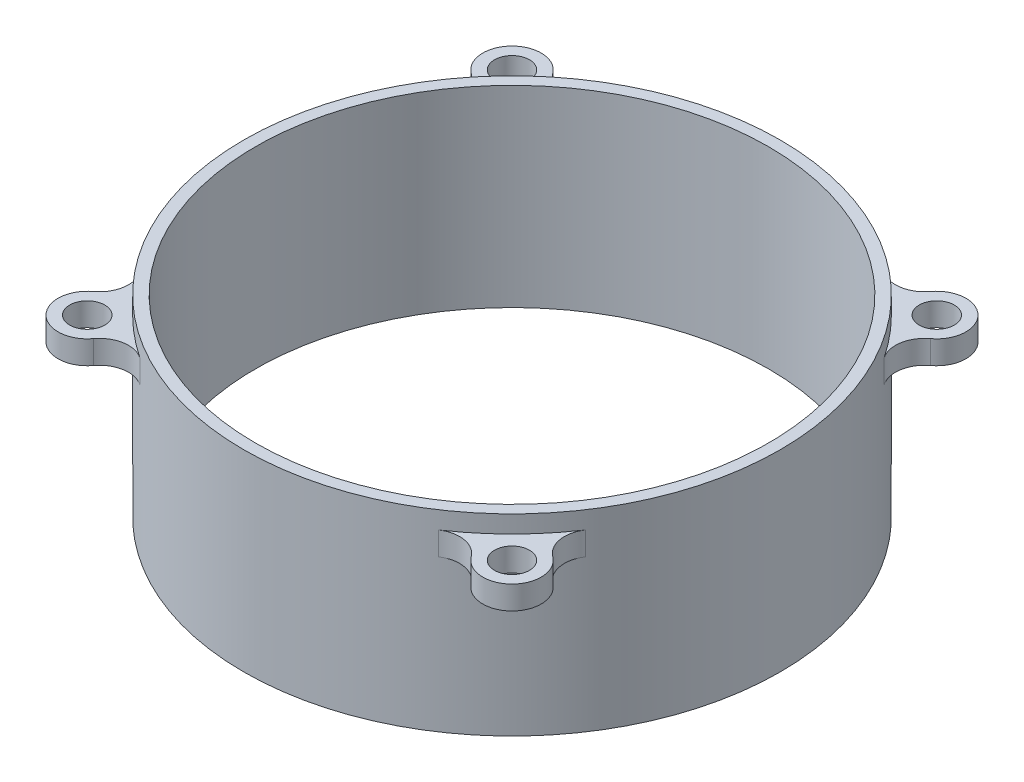
ISO-10303-21;
HEADER;
FILE_DESCRIPTION(('STEP AP214'),'2;1');
FILE_NAME('part.step','',(''),(''),'','','');
FILE_SCHEMA(('AUTOMOTIVE_DESIGN { 1 0 10303 214 1 1 1 1 }'));
ENDSEC;
DATA;
#1=APPLICATION_CONTEXT('core data for automotive mechanical design processes');
#2=APPLICATION_PROTOCOL_DEFINITION('international standard','automotive_design',2000,#1);
#3=PRODUCT_CONTEXT('',#1,'mechanical');
#4=PRODUCT('Part','Part','',(#3));
#5=PRODUCT_RELATED_PRODUCT_CATEGORY('part','',(#4));
#6=PRODUCT_DEFINITION_FORMATION('','',#4);
#7=PRODUCT_DEFINITION_CONTEXT('part definition',#1,'design');
#8=PRODUCT_DEFINITION('design','',#6,#7);
#9=PRODUCT_DEFINITION_SHAPE('','',#8);
#10=(LENGTH_UNIT() NAMED_UNIT(*) SI_UNIT(.MILLI.,.METRE.));
#11=(NAMED_UNIT(*) PLANE_ANGLE_UNIT() SI_UNIT($,.RADIAN.));
#12=(NAMED_UNIT(*) SI_UNIT($,.STERADIAN.) SOLID_ANGLE_UNIT());
#13=UNCERTAINTY_MEASURE_WITH_UNIT(LENGTH_MEASURE(1.E-05),#10,'distance_accuracy_value','');
#14=(GEOMETRIC_REPRESENTATION_CONTEXT(3) GLOBAL_UNCERTAINTY_ASSIGNED_CONTEXT((#13)) GLOBAL_UNIT_ASSIGNED_CONTEXT((#10,
#11,#12)) REPRESENTATION_CONTEXT('',''));
#15=CARTESIAN_POINT('',(0.,0.,0.));
#16=DIRECTION('',(0.,0.,1.));
#17=DIRECTION('',(1.,0.,0.));
#18=AXIS2_PLACEMENT_3D('',#15,#16,#17);
#19=CARTESIAN_POINT('',(23.,-2.,0.));
#20=DIRECTION('',(0.,-1.,0.));
#21=DIRECTION('',(0.,0.,-1.));
#22=AXIS2_PLACEMENT_3D('',#19,#20,#21);
#23=PLANE('',#22);
#24=CARTESIAN_POINT('',(18.2079996155536,-2.,-18.2079996155536));
#25=DIRECTION('',(0.,-1.,0.));
#26=DIRECTION('',(0.,0.,-1.));
#27=AXIS2_PLACEMENT_3D('',#24,#25,#26);
#28=CIRCLE('',#27,1.5);
#29=CARTESIAN_POINT('',(18.2079996155536,-2.,-19.7079996155536));
#30=VERTEX_POINT('',#29);
#31=EDGE_CURVE('E273',#30,#30,#28,.T.);
#32=ORIENTED_EDGE('',*,*,#31,.F.);
#33=EDGE_LOOP('',(#32));
#34=FACE_BOUND('',#33,.T.);
#35=CARTESIAN_POINT('',(0.,-2.,0.));
#36=DIRECTION('',(0.,-1.,0.));
#37=DIRECTION('',(0.,0.,-1.));
#38=AXIS2_PLACEMENT_3D('',#35,#36,#37);
#39=CIRCLE('',#38,23.);
#40=CARTESIAN_POINT('',(12.8002830451665,-2.,-19.1089705103028));
#41=VERTEX_POINT('',#40);
#42=CARTESIAN_POINT('',(19.1089705103028,-2.,-12.8002830451666));
#43=VERTEX_POINT('',#42);
#44=EDGE_CURVE('E291',#41,#43,#39,.T.);
#45=ORIENTED_EDGE('',*,*,#44,.F.);
#46=CARTESIAN_POINT('',(14.1916181587716,-2.,-21.1860325222922));
#47=DIRECTION('',(0.,-1.,0.));
#48=DIRECTION('',(0.,0.,-1.));
#49=AXIS2_PLACEMENT_3D('',#46,#47,#48);
#50=CIRCLE('',#49,2.50000000000001);
#51=CARTESIAN_POINT('',(16.1998088871626,-2.,-19.6970160689229));
#52=VERTEX_POINT('',#51);
#53=EDGE_CURVE('E253',#41,#52,#50,.F.);
#54=ORIENTED_EDGE('',*,*,#53,.T.);
#55=CARTESIAN_POINT('',(18.2079996155536,-2.,-18.2079996155536));
#56=DIRECTION('',(0.,-1.,0.));
#57=DIRECTION('',(0.,0.,-1.));
#58=AXIS2_PLACEMENT_3D('',#55,#56,#57);
#59=CIRCLE('',#58,2.50000000000002);
#60=CARTESIAN_POINT('',(19.6970160689229,-2.,-16.1998088871626));
#61=VERTEX_POINT('',#60);
#62=EDGE_CURVE('E251',#52,#61,#59,.T.);
#63=ORIENTED_EDGE('',*,*,#62,.T.);
#64=CARTESIAN_POINT('',(21.1860325222922,-2.,-14.1916181587716));
#65=DIRECTION('',(0.,-1.,0.));
#66=DIRECTION('',(0.,0.,-1.));
#67=AXIS2_PLACEMENT_3D('',#64,#65,#66);
#68=CIRCLE('',#67,2.5);
#69=EDGE_CURVE('E248',#61,#43,#68,.F.);
#70=ORIENTED_EDGE('',*,*,#69,.T.);
#71=EDGE_LOOP('',(#45,#54,#63,#70));
#72=FACE_BOUND('',#71,.T.);
#73=ADVANCED_FACE('F35',(#34,#72),#23,.T.);
#74=CARTESIAN_POINT('',(18.2079996155536,-2.,18.2079996155536));
#75=DIRECTION('',(0.,-1.,0.));
#76=DIRECTION('',(0.,0.,-1.));
#77=AXIS2_PLACEMENT_3D('',#74,#75,#76);
#78=CIRCLE('',#77,1.5);
#79=CARTESIAN_POINT('',(18.2079996155536,-2.,16.7079996155536));
#80=VERTEX_POINT('',#79);
#81=EDGE_CURVE('E276',#80,#80,#78,.T.);
#82=ORIENTED_EDGE('',*,*,#81,.F.);
#83=EDGE_LOOP('',(#82));
#84=FACE_BOUND('',#83,.T.);
#85=CARTESIAN_POINT('',(19.1089705103028,-2.,12.8002830451665));
#86=VERTEX_POINT('',#85);
#87=CARTESIAN_POINT('',(12.8002830451666,-2.,19.1089705103028));
#88=VERTEX_POINT('',#87);
#89=EDGE_CURVE('E295',#86,#88,#39,.T.);
#90=ORIENTED_EDGE('',*,*,#89,.F.);
#91=CARTESIAN_POINT('',(21.1860325222922,-2.,14.1916181587716));
#92=DIRECTION('',(0.,-1.,0.));
#93=DIRECTION('',(0.,0.,-1.));
#94=AXIS2_PLACEMENT_3D('',#91,#92,#93);
#95=CIRCLE('',#94,2.50000000000001);
#96=CARTESIAN_POINT('',(19.6970160689229,-2.,16.1998088871626));
#97=VERTEX_POINT('',#96);
#98=EDGE_CURVE('E245',#86,#97,#95,.F.);
#99=ORIENTED_EDGE('',*,*,#98,.T.);
#100=CARTESIAN_POINT('',(18.2079996155536,-2.,18.2079996155536));
#101=DIRECTION('',(0.,-1.,0.));
#102=DIRECTION('',(0.,0.,-1.));
#103=AXIS2_PLACEMENT_3D('',#100,#101,#102);
#104=CIRCLE('',#103,2.50000000000002);
#105=CARTESIAN_POINT('',(16.1998088871626,-2.,19.6970160689229));
#106=VERTEX_POINT('',#105);
#107=EDGE_CURVE('E243',#97,#106,#104,.T.);
#108=ORIENTED_EDGE('',*,*,#107,.T.);
#109=CARTESIAN_POINT('',(14.1916181587716,-2.,21.1860325222922));
#110=DIRECTION('',(0.,-1.,0.));
#111=DIRECTION('',(0.,0.,-1.));
#112=AXIS2_PLACEMENT_3D('',#109,#110,#111);
#113=CIRCLE('',#112,2.5);
#114=EDGE_CURVE('E240',#106,#88,#113,.F.);
#115=ORIENTED_EDGE('',*,*,#114,.T.);
#116=EDGE_LOOP('',(#90,#99,#108,#115));
#117=FACE_BOUND('',#116,.T.);
#118=ADVANCED_FACE('F317',(#84,#117),#23,.T.);
#119=CARTESIAN_POINT('',(-18.2079996155536,-2.,18.2079996155536));
#120=DIRECTION('',(0.,-1.,0.));
#121=DIRECTION('',(0.,0.,-1.));
#122=AXIS2_PLACEMENT_3D('',#119,#120,#121);
#123=CIRCLE('',#122,1.5);
#124=CARTESIAN_POINT('',(-18.2079996155536,-2.,16.7079996155536));
#125=VERTEX_POINT('',#124);
#126=EDGE_CURVE('E279',#125,#125,#123,.T.);
#127=ORIENTED_EDGE('',*,*,#126,.F.);
#128=EDGE_LOOP('',(#127));
#129=FACE_BOUND('',#128,.T.);
#130=CARTESIAN_POINT('',(-12.8002830451665,-2.,19.1089705103028));
#131=VERTEX_POINT('',#130);
#132=CARTESIAN_POINT('',(-19.1089705103028,-2.,12.8002830451666));
#133=VERTEX_POINT('',#132);
#134=EDGE_CURVE('E435',#131,#133,#39,.T.);
#135=ORIENTED_EDGE('',*,*,#134,.F.);
#136=CARTESIAN_POINT('',(-14.1916181587716,-2.,21.1860325222922));
#137=DIRECTION('',(0.,-1.,0.));
#138=DIRECTION('',(0.,0.,-1.));
#139=AXIS2_PLACEMENT_3D('',#136,#137,#138);
#140=CIRCLE('',#139,2.50000000000001);
#141=CARTESIAN_POINT('',(-16.1998088871626,-2.,19.6970160689229));
#142=VERTEX_POINT('',#141);
#143=EDGE_CURVE('E237',#131,#142,#140,.F.);
#144=ORIENTED_EDGE('',*,*,#143,.T.);
#145=CARTESIAN_POINT('',(-18.2079996155536,-2.,18.2079996155536));
#146=DIRECTION('',(0.,-1.,0.));
#147=DIRECTION('',(0.,0.,-1.));
#148=AXIS2_PLACEMENT_3D('',#145,#146,#147);
#149=CIRCLE('',#148,2.50000000000002);
#150=CARTESIAN_POINT('',(-19.6970160689229,-2.,16.1998088871626));
#151=VERTEX_POINT('',#150);
#152=EDGE_CURVE('E235',#142,#151,#149,.T.);
#153=ORIENTED_EDGE('',*,*,#152,.T.);
#154=CARTESIAN_POINT('',(-21.1860325222922,-2.,14.1916181587716));
#155=DIRECTION('',(0.,-1.,0.));
#156=DIRECTION('',(0.,0.,-1.));
#157=AXIS2_PLACEMENT_3D('',#154,#155,#156);
#158=CIRCLE('',#157,2.5);
#159=EDGE_CURVE('E232',#151,#133,#158,.F.);
#160=ORIENTED_EDGE('',*,*,#159,.T.);
#161=EDGE_LOOP('',(#135,#144,#153,#160));
#162=FACE_BOUND('',#161,.T.);
#163=ADVANCED_FACE('F323',(#129,#162),#23,.T.);
#164=CARTESIAN_POINT('',(-18.2079996155536,-2.,-18.2079996155536));
#165=DIRECTION('',(0.,-1.,0.));
#166=DIRECTION('',(0.,0.,-1.));
#167=AXIS2_PLACEMENT_3D('',#164,#165,#166);
#168=CIRCLE('',#167,1.5);
#169=CARTESIAN_POINT('',(-18.2079996155536,-2.,-19.7079996155536));
#170=VERTEX_POINT('',#169);
#171=EDGE_CURVE('E270',#170,#170,#168,.T.);
#172=ORIENTED_EDGE('',*,*,#171,.F.);
#173=EDGE_LOOP('',(#172));
#174=FACE_BOUND('',#173,.T.);
#175=CARTESIAN_POINT('',(-18.2079996155536,-2.,-18.2079996155536));
#176=DIRECTION('',(0.,-1.,0.));
#177=DIRECTION('',(0.,0.,-1.));
#178=AXIS2_PLACEMENT_3D('',#175,#176,#177);
#179=CIRCLE('',#178,2.50000000000002);
#180=CARTESIAN_POINT('',(-19.6970160689229,-2.,-16.1998088871626));
#181=VERTEX_POINT('',#180);
#182=CARTESIAN_POINT('',(-16.1998088871626,-2.,-19.6970160689229));
#183=VERTEX_POINT('',#182);
#184=EDGE_CURVE('E50',#181,#183,#179,.T.);
#185=ORIENTED_EDGE('',*,*,#184,.T.);
#186=CARTESIAN_POINT('',(-14.1916181587716,-2.,-21.1860325222922));
#187=DIRECTION('',(0.,-1.,0.));
#188=DIRECTION('',(0.,0.,-1.));
#189=AXIS2_PLACEMENT_3D('',#186,#187,#188);
#190=CIRCLE('',#189,2.5);
#191=CARTESIAN_POINT('',(-12.8002830451666,-2.,-19.1089705103028));
#192=VERTEX_POINT('',#191);
#193=EDGE_CURVE('E256',#183,#192,#190,.F.);
#194=ORIENTED_EDGE('',*,*,#193,.T.);
#195=CARTESIAN_POINT('',(-19.1089705103028,-2.,-12.8002830451665));
#196=VERTEX_POINT('',#195);
#197=EDGE_CURVE('E289',#196,#192,#39,.T.);
#198=ORIENTED_EDGE('',*,*,#197,.F.);
#199=CARTESIAN_POINT('',(-21.1860325222922,-2.,-14.1916181587716));
#200=DIRECTION('',(0.,-1.,0.));
#201=DIRECTION('',(0.,0.,-1.));
#202=AXIS2_PLACEMENT_3D('',#199,#200,#201);
#203=CIRCLE('',#202,2.50000000000001);
#204=EDGE_CURVE('E230',#196,#181,#203,.F.);
#205=ORIENTED_EDGE('',*,*,#204,.T.);
#206=EDGE_LOOP('',(#185,#194,#198,#205));
#207=FACE_BOUND('',#206,.T.);
#208=ADVANCED_FACE('F319',(#174,#207),#23,.T.);
#209=CARTESIAN_POINT('',(28.25,0.,0.));
#210=DIRECTION('',(0.,1.,0.));
#211=DIRECTION('',(0.,0.,1.));
#212=AXIS2_PLACEMENT_3D('',#209,#210,#211);
#213=PLANE('',#212);
#214=CARTESIAN_POINT('',(18.2079996155536,0.,-18.2079996155536));
#215=DIRECTION('',(0.,1.,0.));
#216=DIRECTION('',(0.,0.,1.));
#217=AXIS2_PLACEMENT_3D('',#214,#215,#216);
#218=CIRCLE('',#217,1.5);
#219=CARTESIAN_POINT('',(18.2079996155536,0.,-16.7079996155536));
#220=VERTEX_POINT('',#219);
#221=EDGE_CURVE('E259',#220,#220,#218,.T.);
#222=ORIENTED_EDGE('',*,*,#221,.F.);
#223=EDGE_LOOP('',(#222));
#224=FACE_BOUND('',#223,.T.);
#225=CARTESIAN_POINT('',(18.2079996155536,0.,-18.2079996155536));
#226=DIRECTION('',(0.,1.,0.));
#227=DIRECTION('',(0.,0.,1.));
#228=AXIS2_PLACEMENT_3D('',#225,#226,#227);
#229=CIRCLE('',#228,2.50000000000002);
#230=CARTESIAN_POINT('',(19.6970160689229,0.,-16.1998088871626));
#231=VERTEX_POINT('',#230);
#232=CARTESIAN_POINT('',(16.1998088871626,0.,-19.6970160689229));
#233=VERTEX_POINT('',#232);
#234=EDGE_CURVE('E193',#231,#233,#229,.T.);
#235=ORIENTED_EDGE('',*,*,#234,.T.);
#236=CARTESIAN_POINT('',(14.1916181587716,0.,-21.1860325222922));
#237=DIRECTION('',(0.,-1.,0.));
#238=DIRECTION('',(0.,0.,-1.));
#239=AXIS2_PLACEMENT_3D('',#236,#237,#238);
#240=CIRCLE('',#239,2.50000000000001);
#241=CARTESIAN_POINT('',(12.8002830451665,0.,-19.1089705103028));
#242=VERTEX_POINT('',#241);
#243=EDGE_CURVE('E196',#233,#242,#240,.T.);
#244=ORIENTED_EDGE('',*,*,#243,.T.);
#245=CARTESIAN_POINT('',(0.,0.,0.));
#246=DIRECTION('',(0.,-1.,0.));
#247=DIRECTION('',(0.,0.,-1.));
#248=AXIS2_PLACEMENT_3D('',#245,#246,#247);
#249=CIRCLE('',#248,23.);
#250=CARTESIAN_POINT('',(19.1089705103028,0.,-12.8002830451666));
#251=VERTEX_POINT('',#250);
#252=EDGE_CURVE('E286',#242,#251,#249,.T.);
#253=ORIENTED_EDGE('',*,*,#252,.T.);
#254=CARTESIAN_POINT('',(21.1860325222922,0.,-14.1916181587716));
#255=DIRECTION('',(0.,-1.,0.));
#256=DIRECTION('',(0.,0.,1.));
#257=AXIS2_PLACEMENT_3D('',#254,#255,#256);
#258=CIRCLE('',#257,2.5);
#259=EDGE_CURVE('E190',#251,#231,#258,.T.);
#260=ORIENTED_EDGE('',*,*,#259,.T.);
#261=EDGE_LOOP('',(#235,#244,#253,#260));
#262=FACE_BOUND('',#261,.T.);
#263=ADVANCED_FACE('F329',(#224,#262),#213,.T.);
#264=CARTESIAN_POINT('',(18.2079996155536,0.,18.2079996155536));
#265=DIRECTION('',(0.,1.,0.));
#266=DIRECTION('',(0.,0.,1.));
#267=AXIS2_PLACEMENT_3D('',#264,#265,#266);
#268=CIRCLE('',#267,1.5);
#269=CARTESIAN_POINT('',(18.2079996155536,0.,19.7079996155536));
#270=VERTEX_POINT('',#269);
#271=EDGE_CURVE('E263',#270,#270,#268,.T.);
#272=ORIENTED_EDGE('',*,*,#271,.F.);
#273=EDGE_LOOP('',(#272));
#274=FACE_BOUND('',#273,.T.);
#275=CARTESIAN_POINT('',(18.2079996155536,0.,18.2079996155536));
#276=DIRECTION('',(0.,1.,0.));
#277=DIRECTION('',(0.,0.,1.));
#278=AXIS2_PLACEMENT_3D('',#275,#276,#277);
#279=CIRCLE('',#278,2.50000000000002);
#280=CARTESIAN_POINT('',(16.1998088871626,0.,19.6970160689229));
#281=VERTEX_POINT('',#280);
#282=CARTESIAN_POINT('',(19.6970160689229,0.,16.1998088871626));
#283=VERTEX_POINT('',#282);
#284=EDGE_CURVE('E184',#281,#283,#279,.T.);
#285=ORIENTED_EDGE('',*,*,#284,.T.);
#286=CARTESIAN_POINT('',(21.1860325222922,0.,14.1916181587716));
#287=DIRECTION('',(0.,-1.,0.));
#288=DIRECTION('',(0.,0.,-1.));
#289=AXIS2_PLACEMENT_3D('',#286,#287,#288);
#290=CIRCLE('',#289,2.50000000000001);
#291=CARTESIAN_POINT('',(19.1089705103028,0.,12.8002830451665));
#292=VERTEX_POINT('',#291);
#293=EDGE_CURVE('E187',#283,#292,#290,.T.);
#294=ORIENTED_EDGE('',*,*,#293,.T.);
#295=CARTESIAN_POINT('',(12.8002830451666,0.,19.1089705103028));
#296=VERTEX_POINT('',#295);
#297=EDGE_CURVE('E290',#292,#296,#249,.T.);
#298=ORIENTED_EDGE('',*,*,#297,.T.);
#299=CARTESIAN_POINT('',(14.1916181587716,0.,21.1860325222922));
#300=DIRECTION('',(0.,-1.,0.));
#301=DIRECTION('',(0.,0.,1.));
#302=AXIS2_PLACEMENT_3D('',#299,#300,#301);
#303=CIRCLE('',#302,2.5);
#304=EDGE_CURVE('E58',#296,#281,#303,.T.);
#305=ORIENTED_EDGE('',*,*,#304,.T.);
#306=EDGE_LOOP('',(#285,#294,#298,#305));
#307=FACE_BOUND('',#306,.T.);
#308=ADVANCED_FACE('F335',(#274,#307),#213,.T.);
#309=CARTESIAN_POINT('',(-18.2079996155536,0.,18.2079996155536));
#310=DIRECTION('',(0.,1.,0.));
#311=DIRECTION('',(0.,0.,1.));
#312=AXIS2_PLACEMENT_3D('',#309,#310,#311);
#313=CIRCLE('',#312,1.5);
#314=CARTESIAN_POINT('',(-18.2079996155536,0.,19.7079996155536));
#315=VERTEX_POINT('',#314);
#316=EDGE_CURVE('E258',#315,#315,#313,.T.);
#317=ORIENTED_EDGE('',*,*,#316,.F.);
#318=EDGE_LOOP('',(#317));
#319=FACE_BOUND('',#318,.T.);
#320=CARTESIAN_POINT('',(-18.2079996155536,0.,18.2079996155536));
#321=DIRECTION('',(0.,1.,0.));
#322=DIRECTION('',(0.,0.,1.));
#323=AXIS2_PLACEMENT_3D('',#320,#321,#322);
#324=CIRCLE('',#323,2.50000000000002);
#325=CARTESIAN_POINT('',(-19.6970160689229,0.,16.1998088871626));
#326=VERTEX_POINT('',#325);
#327=CARTESIAN_POINT('',(-16.1998088871626,0.,19.6970160689229));
#328=VERTEX_POINT('',#327);
#329=EDGE_CURVE('E177',#326,#328,#324,.T.);
#330=ORIENTED_EDGE('',*,*,#329,.T.);
#331=CARTESIAN_POINT('',(-14.1916181587716,0.,21.1860325222922));
#332=DIRECTION('',(0.,-1.,0.));
#333=DIRECTION('',(0.,0.,-1.));
#334=AXIS2_PLACEMENT_3D('',#331,#332,#333);
#335=CIRCLE('',#334,2.50000000000001);
#336=CARTESIAN_POINT('',(-12.8002830451665,0.,19.1089705103028));
#337=VERTEX_POINT('',#336);
#338=EDGE_CURVE('E180',#328,#337,#335,.T.);
#339=ORIENTED_EDGE('',*,*,#338,.T.);
#340=CARTESIAN_POINT('',(-19.1089705103028,0.,12.8002830451666));
#341=VERTEX_POINT('',#340);
#342=EDGE_CURVE('E437',#337,#341,#249,.T.);
#343=ORIENTED_EDGE('',*,*,#342,.T.);
#344=CARTESIAN_POINT('',(-21.1860325222922,0.,14.1916181587716));
#345=DIRECTION('',(0.,-1.,0.));
#346=DIRECTION('',(0.,0.,1.));
#347=AXIS2_PLACEMENT_3D('',#344,#345,#346);
#348=CIRCLE('',#347,2.5);
#349=EDGE_CURVE('E166',#341,#326,#348,.T.);
#350=ORIENTED_EDGE('',*,*,#349,.T.);
#351=EDGE_LOOP('',(#330,#339,#343,#350));
#352=FACE_BOUND('',#351,.T.);
#353=ADVANCED_FACE('F347',(#319,#352),#213,.T.);
#354=CARTESIAN_POINT('',(-18.2079996155536,0.,-18.2079996155536));
#355=DIRECTION('',(0.,1.,0.));
#356=DIRECTION('',(0.,0.,1.));
#357=AXIS2_PLACEMENT_3D('',#354,#355,#356);
#358=CIRCLE('',#357,1.5);
#359=CARTESIAN_POINT('',(-18.2079996155536,0.,-16.7079996155536));
#360=VERTEX_POINT('',#359);
#361=EDGE_CURVE('E262',#360,#360,#358,.T.);
#362=ORIENTED_EDGE('',*,*,#361,.F.);
#363=EDGE_LOOP('',(#362));
#364=FACE_BOUND('',#363,.T.);
#365=CARTESIAN_POINT('',(-19.1089705103028,0.,-12.8002830451665));
#366=VERTEX_POINT('',#365);
#367=CARTESIAN_POINT('',(-12.8002830451666,0.,-19.1089705103028));
#368=VERTEX_POINT('',#367);
#369=EDGE_CURVE('E285',#366,#368,#249,.T.);
#370=ORIENTED_EDGE('',*,*,#369,.T.);
#371=CARTESIAN_POINT('',(-14.1916181587716,0.,-21.1860325222922));
#372=DIRECTION('',(0.,-1.,0.));
#373=DIRECTION('',(0.,0.,1.));
#374=AXIS2_PLACEMENT_3D('',#371,#372,#373);
#375=CIRCLE('',#374,2.5);
#376=CARTESIAN_POINT('',(-16.1998088871626,0.,-19.6970160689229));
#377=VERTEX_POINT('',#376);
#378=EDGE_CURVE('E171',#368,#377,#375,.T.);
#379=ORIENTED_EDGE('',*,*,#378,.T.);
#380=CARTESIAN_POINT('',(-18.2079996155536,0.,-18.2079996155536));
#381=DIRECTION('',(0.,1.,0.));
#382=DIRECTION('',(0.,0.,1.));
#383=AXIS2_PLACEMENT_3D('',#380,#381,#382);
#384=CIRCLE('',#383,2.50000000000002);
#385=CARTESIAN_POINT('',(-19.6970160689229,0.,-16.1998088871626));
#386=VERTEX_POINT('',#385);
#387=EDGE_CURVE('E153',#377,#386,#384,.T.);
#388=ORIENTED_EDGE('',*,*,#387,.T.);
#389=CARTESIAN_POINT('',(-21.1860325222922,0.,-14.1916181587716));
#390=DIRECTION('',(0.,-1.,0.));
#391=DIRECTION('',(0.,0.,-1.));
#392=AXIS2_PLACEMENT_3D('',#389,#390,#391);
#393=CIRCLE('',#392,2.50000000000001);
#394=EDGE_CURVE('E160',#386,#366,#393,.T.);
#395=ORIENTED_EDGE('',*,*,#394,.T.);
#396=EDGE_LOOP('',(#370,#379,#388,#395));
#397=FACE_BOUND('',#396,.T.);
#398=ADVANCED_FACE('F169',(#364,#397),#213,.T.);
#399=CARTESIAN_POINT('',(23.,1.5,0.));
#400=DIRECTION('',(0.,1.,0.));
#401=DIRECTION('',(0.,0.,1.));
#402=AXIS2_PLACEMENT_3D('',#399,#400,#401);
#403=PLANE('',#402);
#404=CARTESIAN_POINT('',(0.,1.5,0.));
#405=DIRECTION('',(0.,-1.,0.));
#406=DIRECTION('',(0.,0.,-1.));
#407=AXIS2_PLACEMENT_3D('',#404,#405,#406);
#408=CIRCLE('',#407,22.);
#409=CARTESIAN_POINT('',(0.,1.5,-22.));
#410=VERTEX_POINT('',#409);
#411=EDGE_CURVE('E12',#410,#410,#408,.T.);
#412=ORIENTED_EDGE('',*,*,#411,.T.);
#413=EDGE_LOOP('',(#412));
#414=FACE_BOUND('',#413,.T.);
#415=CARTESIAN_POINT('',(0.,1.5,0.));
#416=DIRECTION('',(0.,-1.,0.));
#417=DIRECTION('',(0.,0.,-1.));
#418=AXIS2_PLACEMENT_3D('',#415,#416,#417);
#419=CIRCLE('',#418,23.);
#420=CARTESIAN_POINT('',(0.,1.5,-23.));
#421=VERTEX_POINT('',#420);
#422=EDGE_CURVE('E282',#421,#421,#419,.T.);
#423=ORIENTED_EDGE('',*,*,#422,.F.);
#424=EDGE_LOOP('',(#423));
#425=FACE_BOUND('',#424,.T.);
#426=ADVANCED_FACE('F37',(#414,#425),#403,.T.);
#427=CARTESIAN_POINT('',(0.,0.,0.));
#428=DIRECTION('',(0.,-1.,0.));
#429=DIRECTION('',(0.,0.,-1.));
#430=AXIS2_PLACEMENT_3D('',#427,#428,#429);
#431=CYLINDRICAL_SURFACE('',#430,22.);
#432=CARTESIAN_POINT('',(0.,-15.,0.));
#433=DIRECTION('',(0.,-1.,0.));
#434=DIRECTION('',(0.,0.,-1.));
#435=AXIS2_PLACEMENT_3D('',#432,#433,#434);
#436=CIRCLE('',#435,22.);
#437=CARTESIAN_POINT('',(0.,-15.,-22.));
#438=VERTEX_POINT('',#437);
#439=EDGE_CURVE('E43',#438,#438,#436,.T.);
#440=ORIENTED_EDGE('',*,*,#439,.T.);
#441=EDGE_LOOP('',(#440));
#442=FACE_BOUND('',#441,.T.);
#443=ORIENTED_EDGE('',*,*,#411,.F.);
#444=EDGE_LOOP('',(#443));
#445=FACE_BOUND('',#444,.T.);
#446=ADVANCED_FACE('F300',(#442,#445),#431,.F.);
#447=CARTESIAN_POINT('',(22.,-15.,0.));
#448=DIRECTION('',(0.,-1.,0.));
#449=DIRECTION('',(0.,0.,-1.));
#450=AXIS2_PLACEMENT_3D('',#447,#448,#449);
#451=PLANE('',#450);
#452=CARTESIAN_POINT('',(0.,-15.,0.));
#453=DIRECTION('',(0.,-1.,0.));
#454=DIRECTION('',(0.,0.,-1.));
#455=AXIS2_PLACEMENT_3D('',#452,#453,#454);
#456=CIRCLE('',#455,23.);
#457=CARTESIAN_POINT('',(0.,-15.,-23.));
#458=VERTEX_POINT('',#457);
#459=EDGE_CURVE('E294',#458,#458,#456,.T.);
#460=ORIENTED_EDGE('',*,*,#459,.T.);
#461=EDGE_LOOP('',(#460));
#462=FACE_BOUND('',#461,.T.);
#463=ORIENTED_EDGE('',*,*,#439,.F.);
#464=EDGE_LOOP('',(#463));
#465=FACE_BOUND('',#464,.T.);
#466=ADVANCED_FACE('F303',(#462,#465),#451,.T.);
#467=CARTESIAN_POINT('',(0.,0.,0.));
#468=DIRECTION('',(0.,-1.,0.));
#469=DIRECTION('',(0.,0.,-1.));
#470=AXIS2_PLACEMENT_3D('',#467,#468,#469);
#471=CYLINDRICAL_SURFACE('',#470,23.);
#472=ORIENTED_EDGE('',*,*,#197,.T.);
#473=DIRECTION('',(0.,1.,0.));
#474=VECTOR('',#473,1.);
#475=CARTESIAN_POINT('',(-12.8002830451666,-15.,-19.1089705103028));
#476=LINE('',#475,#474);
#477=EDGE_CURVE('E199',#192,#368,#476,.T.);
#478=ORIENTED_EDGE('',*,*,#477,.T.);
#479=ORIENTED_EDGE('',*,*,#369,.F.);
#480=DIRECTION('',(0.,1.,0.));
#481=VECTOR('',#480,1.);
#482=CARTESIAN_POINT('',(-19.1089705103028,-15.,-12.8002830451665));
#483=LINE('',#482,#481);
#484=EDGE_CURVE('E156',#196,#366,#483,.T.);
#485=ORIENTED_EDGE('',*,*,#484,.F.);
#486=EDGE_LOOP('',(#472,#478,#479,#485));
#487=FACE_BOUND('',#486,.T.);
#488=DIRECTION('',(0.,1.,0.));
#489=VECTOR('',#488,1.);
#490=CARTESIAN_POINT('',(12.8002830451665,-15.,-19.1089705103028));
#491=LINE('',#490,#489);
#492=EDGE_CURVE('E201',#41,#242,#491,.T.);
#493=ORIENTED_EDGE('',*,*,#492,.F.);
#494=ORIENTED_EDGE('',*,*,#44,.T.);
#495=DIRECTION('',(0.,1.,0.));
#496=VECTOR('',#495,1.);
#497=CARTESIAN_POINT('',(19.1089705103028,-15.,-12.8002830451666));
#498=LINE('',#497,#496);
#499=EDGE_CURVE('E208',#43,#251,#498,.T.);
#500=ORIENTED_EDGE('',*,*,#499,.T.);
#501=ORIENTED_EDGE('',*,*,#252,.F.);
#502=EDGE_LOOP('',(#493,#494,#500,#501));
#503=FACE_BOUND('',#502,.T.);
#504=DIRECTION('',(0.,1.,0.));
#505=VECTOR('',#504,1.);
#506=CARTESIAN_POINT('',(19.1089705103028,-15.,12.8002830451665));
#507=LINE('',#506,#505);
#508=EDGE_CURVE('E210',#86,#292,#507,.T.);
#509=ORIENTED_EDGE('',*,*,#508,.F.);
#510=ORIENTED_EDGE('',*,*,#89,.T.);
#511=DIRECTION('',(0.,1.,0.));
#512=VECTOR('',#511,1.);
#513=CARTESIAN_POINT('',(12.8002830451666,-15.,19.1089705103028));
#514=LINE('',#513,#512);
#515=EDGE_CURVE('E216',#88,#296,#514,.T.);
#516=ORIENTED_EDGE('',*,*,#515,.T.);
#517=ORIENTED_EDGE('',*,*,#297,.F.);
#518=EDGE_LOOP('',(#509,#510,#516,#517));
#519=FACE_BOUND('',#518,.T.);
#520=DIRECTION('',(0.,1.,0.));
#521=VECTOR('',#520,1.);
#522=CARTESIAN_POINT('',(-12.8002830451665,-15.,19.1089705103028));
#523=LINE('',#522,#521);
#524=EDGE_CURVE('E218',#131,#337,#523,.T.);
#525=ORIENTED_EDGE('',*,*,#524,.F.);
#526=ORIENTED_EDGE('',*,*,#134,.T.);
#527=DIRECTION('',(0.,1.,0.));
#528=VECTOR('',#527,1.);
#529=CARTESIAN_POINT('',(-19.1089705103028,-15.,12.8002830451666));
#530=LINE('',#529,#528);
#531=EDGE_CURVE('E225',#133,#341,#530,.T.);
#532=ORIENTED_EDGE('',*,*,#531,.T.);
#533=ORIENTED_EDGE('',*,*,#342,.F.);
#534=EDGE_LOOP('',(#525,#526,#532,#533));
#535=FACE_BOUND('',#534,.T.);
#536=ORIENTED_EDGE('',*,*,#422,.T.);
#537=EDGE_LOOP('',(#536));
#538=FACE_BOUND('',#537,.T.);
#539=ORIENTED_EDGE('',*,*,#459,.F.);
#540=EDGE_LOOP('',(#539));
#541=FACE_BOUND('',#540,.T.);
#542=ADVANCED_FACE('F305',(#487,#503,#519,#535,#538,#541),#471,.T.);
#543=CARTESIAN_POINT('',(-18.2079996155536,-15.,-18.2079996155536));
#544=DIRECTION('',(0.,1.,0.));
#545=DIRECTION('',(0.,0.,1.));
#546=AXIS2_PLACEMENT_3D('',#543,#544,#545);
#547=CYLINDRICAL_SURFACE('',#546,1.5);
#548=ORIENTED_EDGE('',*,*,#171,.T.);
#549=EDGE_LOOP('',(#548));
#550=FACE_BOUND('',#549,.T.);
#551=ORIENTED_EDGE('',*,*,#361,.T.);
#552=EDGE_LOOP('',(#551));
#553=FACE_BOUND('',#552,.T.);
#554=ADVANCED_FACE('F312',(#550,#553),#547,.F.);
#555=CARTESIAN_POINT('',(18.2079996155536,-15.,-18.2079996155536));
#556=DIRECTION('',(0.,1.,0.));
#557=DIRECTION('',(0.,0.,1.));
#558=AXIS2_PLACEMENT_3D('',#555,#556,#557);
#559=CYLINDRICAL_SURFACE('',#558,1.5);
#560=ORIENTED_EDGE('',*,*,#31,.T.);
#561=EDGE_LOOP('',(#560));
#562=FACE_BOUND('',#561,.T.);
#563=ORIENTED_EDGE('',*,*,#221,.T.);
#564=EDGE_LOOP('',(#563));
#565=FACE_BOUND('',#564,.T.);
#566=ADVANCED_FACE('F342',(#562,#565),#559,.F.);
#567=CARTESIAN_POINT('',(18.2079996155536,-15.,18.2079996155536));
#568=DIRECTION('',(0.,1.,0.));
#569=DIRECTION('',(0.,0.,1.));
#570=AXIS2_PLACEMENT_3D('',#567,#568,#569);
#571=CYLINDRICAL_SURFACE('',#570,1.5);
#572=ORIENTED_EDGE('',*,*,#81,.T.);
#573=EDGE_LOOP('',(#572));
#574=FACE_BOUND('',#573,.T.);
#575=ORIENTED_EDGE('',*,*,#271,.T.);
#576=EDGE_LOOP('',(#575));
#577=FACE_BOUND('',#576,.T.);
#578=ADVANCED_FACE('F359',(#574,#577),#571,.F.);
#579=CARTESIAN_POINT('',(-18.2079996155536,-15.,18.2079996155536));
#580=DIRECTION('',(0.,1.,0.));
#581=DIRECTION('',(0.,0.,1.));
#582=AXIS2_PLACEMENT_3D('',#579,#580,#581);
#583=CYLINDRICAL_SURFACE('',#582,1.5);
#584=ORIENTED_EDGE('',*,*,#126,.T.);
#585=EDGE_LOOP('',(#584));
#586=FACE_BOUND('',#585,.T.);
#587=ORIENTED_EDGE('',*,*,#316,.T.);
#588=EDGE_LOOP('',(#587));
#589=FACE_BOUND('',#588,.T.);
#590=ADVANCED_FACE('F355',(#586,#589),#583,.F.);
#591=CARTESIAN_POINT('',(18.2079996155536,-15.,-18.2079996155536));
#592=DIRECTION('',(0.,1.,0.));
#593=DIRECTION('',(0.,0.,1.));
#594=AXIS2_PLACEMENT_3D('',#591,#592,#593);
#595=CYLINDRICAL_SURFACE('',#594,2.50000000000002);
#596=DIRECTION('',(0.,1.,0.));
#597=VECTOR('',#596,1.);
#598=CARTESIAN_POINT('',(16.1998088871626,-15.,-19.6970160689229));
#599=LINE('',#598,#597);
#600=EDGE_CURVE('E203',#52,#233,#599,.T.);
#601=ORIENTED_EDGE('',*,*,#600,.T.);
#602=ORIENTED_EDGE('',*,*,#234,.F.);
#603=DIRECTION('',(0.,1.,0.));
#604=VECTOR('',#603,1.);
#605=CARTESIAN_POINT('',(19.6970160689229,-15.,-16.1998088871626));
#606=LINE('',#605,#604);
#607=EDGE_CURVE('E205',#61,#231,#606,.T.);
#608=ORIENTED_EDGE('',*,*,#607,.F.);
#609=ORIENTED_EDGE('',*,*,#62,.F.);
#610=EDGE_LOOP('',(#601,#602,#608,#609));
#611=FACE_BOUND('',#610,.T.);
#612=ADVANCED_FACE('F358',(#611),#595,.T.);
#613=CARTESIAN_POINT('',(18.2079996155536,-15.,18.2079996155536));
#614=DIRECTION('',(0.,1.,0.));
#615=DIRECTION('',(0.,0.,1.));
#616=AXIS2_PLACEMENT_3D('',#613,#614,#615);
#617=CYLINDRICAL_SURFACE('',#616,2.50000000000002);
#618=DIRECTION('',(0.,1.,0.));
#619=VECTOR('',#618,1.);
#620=CARTESIAN_POINT('',(19.6970160689229,-15.,16.1998088871626));
#621=LINE('',#620,#619);
#622=EDGE_CURVE('E212',#97,#283,#621,.T.);
#623=ORIENTED_EDGE('',*,*,#622,.T.);
#624=ORIENTED_EDGE('',*,*,#284,.F.);
#625=DIRECTION('',(0.,1.,0.));
#626=VECTOR('',#625,1.);
#627=CARTESIAN_POINT('',(16.1998088871626,-15.,19.6970160689229));
#628=LINE('',#627,#626);
#629=EDGE_CURVE('E214',#106,#281,#628,.T.);
#630=ORIENTED_EDGE('',*,*,#629,.F.);
#631=ORIENTED_EDGE('',*,*,#107,.F.);
#632=EDGE_LOOP('',(#623,#624,#630,#631));
#633=FACE_BOUND('',#632,.T.);
#634=ADVANCED_FACE('F384',(#633),#617,.T.);
#635=CARTESIAN_POINT('',(-18.2079996155536,-15.,18.2079996155536));
#636=DIRECTION('',(0.,1.,0.));
#637=DIRECTION('',(0.,0.,1.));
#638=AXIS2_PLACEMENT_3D('',#635,#636,#637);
#639=CYLINDRICAL_SURFACE('',#638,2.50000000000002);
#640=DIRECTION('',(0.,1.,0.));
#641=VECTOR('',#640,1.);
#642=CARTESIAN_POINT('',(-16.1998088871626,-15.,19.6970160689229));
#643=LINE('',#642,#641);
#644=EDGE_CURVE('E220',#142,#328,#643,.T.);
#645=ORIENTED_EDGE('',*,*,#644,.T.);
#646=ORIENTED_EDGE('',*,*,#329,.F.);
#647=DIRECTION('',(0.,1.,0.));
#648=VECTOR('',#647,1.);
#649=CARTESIAN_POINT('',(-19.6970160689229,-15.,16.1998088871626));
#650=LINE('',#649,#648);
#651=EDGE_CURVE('E222',#151,#326,#650,.T.);
#652=ORIENTED_EDGE('',*,*,#651,.F.);
#653=ORIENTED_EDGE('',*,*,#152,.F.);
#654=EDGE_LOOP('',(#645,#646,#652,#653));
#655=FACE_BOUND('',#654,.T.);
#656=ADVANCED_FACE('F374',(#655),#639,.T.);
#657=CARTESIAN_POINT('',(-18.2079996155536,-15.,-18.2079996155536));
#658=DIRECTION('',(0.,1.,0.));
#659=DIRECTION('',(0.,0.,1.));
#660=AXIS2_PLACEMENT_3D('',#657,#658,#659);
#661=CYLINDRICAL_SURFACE('',#660,2.50000000000002);
#662=DIRECTION('',(0.,1.,0.));
#663=VECTOR('',#662,1.);
#664=CARTESIAN_POINT('',(-19.6970160689229,-15.,-16.1998088871626));
#665=LINE('',#664,#663);
#666=EDGE_CURVE('E149',#181,#386,#665,.T.);
#667=ORIENTED_EDGE('',*,*,#666,.T.);
#668=ORIENTED_EDGE('',*,*,#387,.F.);
#669=DIRECTION('',(0.,1.,0.));
#670=VECTOR('',#669,1.);
#671=CARTESIAN_POINT('',(-16.1998088871626,-15.,-19.6970160689229));
#672=LINE('',#671,#670);
#673=EDGE_CURVE('E157',#183,#377,#672,.T.);
#674=ORIENTED_EDGE('',*,*,#673,.F.);
#675=ORIENTED_EDGE('',*,*,#184,.F.);
#676=EDGE_LOOP('',(#667,#668,#674,#675));
#677=FACE_BOUND('',#676,.T.);
#678=ADVANCED_FACE('F151',(#677),#661,.T.);
#679=CARTESIAN_POINT('',(-14.1916181587716,-15.,-21.1860325222922));
#680=DIRECTION('',(0.,1.,0.));
#681=DIRECTION('',(0.,0.,1.));
#682=AXIS2_PLACEMENT_3D('',#679,#680,#681);
#683=CYLINDRICAL_SURFACE('',#682,2.5);
#684=ORIENTED_EDGE('',*,*,#673,.T.);
#685=ORIENTED_EDGE('',*,*,#378,.F.);
#686=ORIENTED_EDGE('',*,*,#477,.F.);
#687=ORIENTED_EDGE('',*,*,#193,.F.);
#688=EDGE_LOOP('',(#684,#685,#686,#687));
#689=FACE_BOUND('',#688,.T.);
#690=ADVANCED_FACE('F367',(#689),#683,.F.);
#691=CARTESIAN_POINT('',(14.1916181587716,-15.,-21.1860325222922));
#692=DIRECTION('',(0.,1.,0.));
#693=DIRECTION('',(0.,0.,1.));
#694=AXIS2_PLACEMENT_3D('',#691,#692,#693);
#695=CYLINDRICAL_SURFACE('',#694,2.50000000000001);
#696=ORIENTED_EDGE('',*,*,#492,.T.);
#697=ORIENTED_EDGE('',*,*,#243,.F.);
#698=ORIENTED_EDGE('',*,*,#600,.F.);
#699=ORIENTED_EDGE('',*,*,#53,.F.);
#700=EDGE_LOOP('',(#696,#697,#698,#699));
#701=FACE_BOUND('',#700,.T.);
#702=ADVANCED_FACE('F370',(#701),#695,.F.);
#703=CARTESIAN_POINT('',(21.1860325222922,-15.,-14.1916181587716));
#704=DIRECTION('',(0.,1.,0.));
#705=DIRECTION('',(0.,0.,1.));
#706=AXIS2_PLACEMENT_3D('',#703,#704,#705);
#707=CYLINDRICAL_SURFACE('',#706,2.5);
#708=ORIENTED_EDGE('',*,*,#607,.T.);
#709=ORIENTED_EDGE('',*,*,#259,.F.);
#710=ORIENTED_EDGE('',*,*,#499,.F.);
#711=ORIENTED_EDGE('',*,*,#69,.F.);
#712=EDGE_LOOP('',(#708,#709,#710,#711));
#713=FACE_BOUND('',#712,.T.);
#714=ADVANCED_FACE('F398',(#713),#707,.F.);
#715=CARTESIAN_POINT('',(21.1860325222922,-15.,14.1916181587716));
#716=DIRECTION('',(0.,1.,0.));
#717=DIRECTION('',(0.,0.,1.));
#718=AXIS2_PLACEMENT_3D('',#715,#716,#717);
#719=CYLINDRICAL_SURFACE('',#718,2.50000000000001);
#720=ORIENTED_EDGE('',*,*,#508,.T.);
#721=ORIENTED_EDGE('',*,*,#293,.F.);
#722=ORIENTED_EDGE('',*,*,#622,.F.);
#723=ORIENTED_EDGE('',*,*,#98,.F.);
#724=EDGE_LOOP('',(#720,#721,#722,#723));
#725=FACE_BOUND('',#724,.T.);
#726=ADVANCED_FACE('F392',(#725),#719,.F.);
#727=CARTESIAN_POINT('',(14.1916181587716,-15.,21.1860325222922));
#728=DIRECTION('',(0.,1.,0.));
#729=DIRECTION('',(0.,0.,1.));
#730=AXIS2_PLACEMENT_3D('',#727,#728,#729);
#731=CYLINDRICAL_SURFACE('',#730,2.5);
#732=ORIENTED_EDGE('',*,*,#629,.T.);
#733=ORIENTED_EDGE('',*,*,#304,.F.);
#734=ORIENTED_EDGE('',*,*,#515,.F.);
#735=ORIENTED_EDGE('',*,*,#114,.F.);
#736=EDGE_LOOP('',(#732,#733,#734,#735));
#737=FACE_BOUND('',#736,.T.);
#738=ADVANCED_FACE('F388',(#737),#731,.F.);
#739=CARTESIAN_POINT('',(-14.1916181587716,-15.,21.1860325222922));
#740=DIRECTION('',(0.,1.,0.));
#741=DIRECTION('',(0.,0.,1.));
#742=AXIS2_PLACEMENT_3D('',#739,#740,#741);
#743=CYLINDRICAL_SURFACE('',#742,2.50000000000001);
#744=ORIENTED_EDGE('',*,*,#524,.T.);
#745=ORIENTED_EDGE('',*,*,#338,.F.);
#746=ORIENTED_EDGE('',*,*,#644,.F.);
#747=ORIENTED_EDGE('',*,*,#143,.F.);
#748=EDGE_LOOP('',(#744,#745,#746,#747));
#749=FACE_BOUND('',#748,.T.);
#750=ADVANCED_FACE('F380',(#749),#743,.F.);
#751=CARTESIAN_POINT('',(-21.1860325222922,-15.,14.1916181587716));
#752=DIRECTION('',(0.,1.,0.));
#753=DIRECTION('',(0.,0.,1.));
#754=AXIS2_PLACEMENT_3D('',#751,#752,#753);
#755=CYLINDRICAL_SURFACE('',#754,2.5);
#756=ORIENTED_EDGE('',*,*,#651,.T.);
#757=ORIENTED_EDGE('',*,*,#349,.F.);
#758=ORIENTED_EDGE('',*,*,#531,.F.);
#759=ORIENTED_EDGE('',*,*,#159,.F.);
#760=EDGE_LOOP('',(#756,#757,#758,#759));
#761=FACE_BOUND('',#760,.T.);
#762=ADVANCED_FACE('F377',(#761),#755,.F.);
#763=CARTESIAN_POINT('',(-21.1860325222922,-15.,-14.1916181587716));
#764=DIRECTION('',(0.,1.,0.));
#765=DIRECTION('',(0.,0.,1.));
#766=AXIS2_PLACEMENT_3D('',#763,#764,#765);
#767=CYLINDRICAL_SURFACE('',#766,2.50000000000001);
#768=ORIENTED_EDGE('',*,*,#484,.T.);
#769=ORIENTED_EDGE('',*,*,#394,.F.);
#770=ORIENTED_EDGE('',*,*,#666,.F.);
#771=ORIENTED_EDGE('',*,*,#204,.F.);
#772=EDGE_LOOP('',(#768,#769,#770,#771));
#773=FACE_BOUND('',#772,.T.);
#774=ADVANCED_FACE('F161',(#773),#767,.F.);
#775=CLOSED_SHELL('',(#73,#118,#163,#208,#263,#308,#353,#398,#426,#446,#466,#542,#554,#566,#578,
#590,#612,#634,#656,#678,#690,#702,#714,#726,#738,#750,#762,#774));
#776=MANIFOLD_SOLID_BREP('B2',#775);
#777=ADVANCED_BREP_SHAPE_REPRESENTATION('',(#18,#776),#14);
#778=SHAPE_DEFINITION_REPRESENTATION(#9,#777);
ENDSEC;
END-ISO-10303-21;
